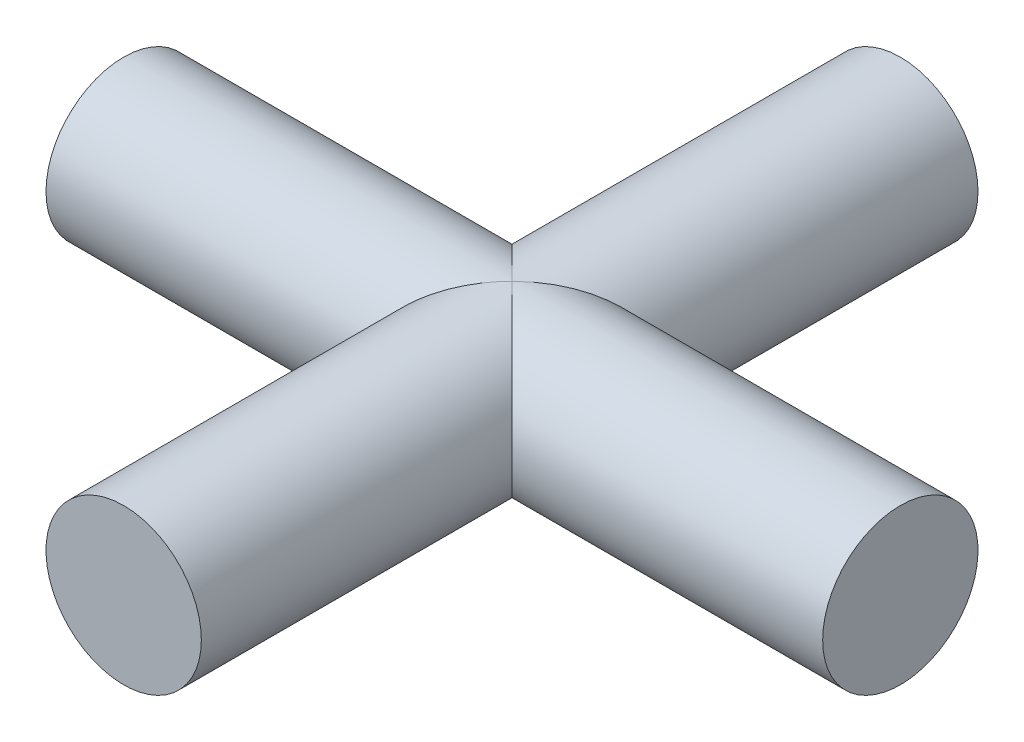
ISO-10303-21;
HEADER;
FILE_DESCRIPTION(('STEP AP214'),'2;1');
FILE_NAME('part.step','',(''),(''),'','','');
FILE_SCHEMA(('AUTOMOTIVE_DESIGN { 1 0 10303 214 1 1 1 1 }'));
ENDSEC;
DATA;
#1=APPLICATION_CONTEXT('core data for automotive mechanical design processes');
#2=APPLICATION_PROTOCOL_DEFINITION('international standard','automotive_design',2000,#1);
#3=PRODUCT_CONTEXT('',#1,'mechanical');
#4=PRODUCT('Part','Part','',(#3));
#5=PRODUCT_RELATED_PRODUCT_CATEGORY('part','',(#4));
#6=PRODUCT_DEFINITION_FORMATION('','',#4);
#7=PRODUCT_DEFINITION_CONTEXT('part definition',#1,'design');
#8=PRODUCT_DEFINITION('design','',#6,#7);
#9=PRODUCT_DEFINITION_SHAPE('','',#8);
#10=(LENGTH_UNIT() NAMED_UNIT(*) SI_UNIT(.MILLI.,.METRE.));
#11=(NAMED_UNIT(*) PLANE_ANGLE_UNIT() SI_UNIT($,.RADIAN.));
#12=(NAMED_UNIT(*) SI_UNIT($,.STERADIAN.) SOLID_ANGLE_UNIT());
#13=UNCERTAINTY_MEASURE_WITH_UNIT(LENGTH_MEASURE(1.E-05),#10,'distance_accuracy_value','');
#14=(GEOMETRIC_REPRESENTATION_CONTEXT(3) GLOBAL_UNCERTAINTY_ASSIGNED_CONTEXT((#13)) GLOBAL_UNIT_ASSIGNED_CONTEXT((#10,
#11,#12)) REPRESENTATION_CONTEXT('',''));
#15=CARTESIAN_POINT('',(0.,0.,0.));
#16=DIRECTION('',(0.,0.,1.));
#17=DIRECTION('',(1.,0.,0.));
#18=AXIS2_PLACEMENT_3D('',#15,#16,#17);
#19=CARTESIAN_POINT('',(0.,0.,63.5));
#20=DIRECTION('',(0.,0.,-1.));
#21=DIRECTION('',(-1.,0.,0.));
#22=AXIS2_PLACEMENT_3D('',#19,#20,#21);
#23=CYLINDRICAL_SURFACE('',#22,6.35);
#24=CARTESIAN_POINT('',(0.,0.,63.5));
#25=DIRECTION('',(0.,0.,1.));
#26=DIRECTION('',(1.,0.,0.));
#27=AXIS2_PLACEMENT_3D('',#24,#25,#26);
#28=CIRCLE('',#27,6.35);
#29=CARTESIAN_POINT('',(6.35,0.,63.5));
#30=VERTEX_POINT('',#29);
#31=EDGE_CURVE('E66',#30,#30,#28,.T.);
#32=ORIENTED_EDGE('',*,*,#31,.F.);
#33=EDGE_LOOP('',(#32));
#34=FACE_BOUND('',#33,.T.);
#35=CARTESIAN_POINT('',(0.,0.,31.75));
#36=DIRECTION('',(0.707106781186549,0.,-0.707106781186546));
#37=DIRECTION('',(-0.707106781186546,0.,-0.707106781186549));
#38=AXIS2_PLACEMENT_3D('',#35,#36,#37);
#39=ELLIPSE('',#38,8.98025612106917,6.35);
#40=CARTESIAN_POINT('',(0.,6.35,31.75));
#41=VERTEX_POINT('',#40);
#42=CARTESIAN_POINT('',(0.,-6.35,31.75));
#43=VERTEX_POINT('',#42);
#44=EDGE_CURVE('E48',#41,#43,#39,.T.);
#45=ORIENTED_EDGE('',*,*,#44,.F.);
#46=CARTESIAN_POINT('',(0.,0.,31.75));
#47=DIRECTION('',(-0.707106781186546,0.,-0.707106781186549));
#48=DIRECTION('',(0.707106781186549,0.,-0.707106781186546));
#49=AXIS2_PLACEMENT_3D('',#46,#47,#48);
#50=ELLIPSE('',#49,8.98025612106913,6.35);
#51=EDGE_CURVE('E60',#43,#41,#50,.T.);
#52=ORIENTED_EDGE('',*,*,#51,.F.);
#53=EDGE_LOOP('',(#45,#52));
#54=FACE_BOUND('',#53,.T.);
#55=ADVANCED_FACE('F39',(#34,#54),#23,.T.);
#56=CARTESIAN_POINT('',(0.,0.,63.5));
#57=DIRECTION('',(0.,0.,1.));
#58=DIRECTION('',(1.,0.,0.));
#59=AXIS2_PLACEMENT_3D('',#56,#57,#58);
#60=PLANE('',#59);
#61=ORIENTED_EDGE('',*,*,#31,.T.);
#62=EDGE_LOOP('',(#61));
#63=FACE_BOUND('',#62,.T.);
#64=ADVANCED_FACE('F90',(#63),#60,.T.);
#65=CARTESIAN_POINT('',(31.75,0.,31.7500000000001));
#66=DIRECTION('',(-1.,0.,0.));
#67=DIRECTION('',(0.,0.,1.));
#68=AXIS2_PLACEMENT_3D('',#65,#66,#67);
#69=PLANE('',#68);
#70=CARTESIAN_POINT('',(31.75,0.,31.7500000000001));
#71=DIRECTION('',(-1.,0.,0.));
#72=DIRECTION('',(0.,0.,1.));
#73=AXIS2_PLACEMENT_3D('',#70,#71,#72);
#74=CIRCLE('',#73,6.35);
#75=CARTESIAN_POINT('',(31.75,0.,38.1000000000001));
#76=VERTEX_POINT('',#75);
#77=EDGE_CURVE('E106',#76,#76,#74,.T.);
#78=ORIENTED_EDGE('',*,*,#77,.F.);
#79=EDGE_LOOP('',(#78));
#80=FACE_BOUND('',#79,.T.);
#81=ADVANCED_FACE('F87',(#80),#69,.F.);
#82=CARTESIAN_POINT('',(-31.75,0.,31.7499999999999));
#83=DIRECTION('',(1.,0.,0.));
#84=DIRECTION('',(0.,0.,-1.));
#85=AXIS2_PLACEMENT_3D('',#82,#83,#84);
#86=CYLINDRICAL_SURFACE('',#85,6.35);
#87=ORIENTED_EDGE('',*,*,#77,.T.);
#88=EDGE_LOOP('',(#87));
#89=FACE_BOUND('',#88,.T.);
#90=CARTESIAN_POINT('',(0.,0.,31.75));
#91=DIRECTION('',(-0.707106781186546,0.,-0.707106781186549));
#92=DIRECTION('',(0.707106781186549,0.,-0.707106781186546));
#93=AXIS2_PLACEMENT_3D('',#90,#91,#92);
#94=ELLIPSE('',#93,8.98025612106913,6.35);
#95=EDGE_CURVE('E54',#43,#41,#94,.F.);
#96=ORIENTED_EDGE('',*,*,#95,.T.);
#97=ORIENTED_EDGE('',*,*,#44,.T.);
#98=EDGE_LOOP('',(#96,#97));
#99=FACE_BOUND('',#98,.T.);
#100=ADVANCED_FACE('F68',(#89,#99),#86,.T.);
#101=CARTESIAN_POINT('',(0.,0.,0.));
#102=DIRECTION('',(0.,0.,1.));
#103=DIRECTION('',(1.,0.,0.));
#104=AXIS2_PLACEMENT_3D('',#101,#102,#103);
#105=PLANE('',#104);
#106=CARTESIAN_POINT('',(0.,0.,0.));
#107=DIRECTION('',(0.,0.,1.));
#108=DIRECTION('',(1.,0.,0.));
#109=AXIS2_PLACEMENT_3D('',#106,#107,#108);
#110=CIRCLE('',#109,6.35);
#111=CARTESIAN_POINT('',(6.35,0.,0.));
#112=VERTEX_POINT('',#111);
#113=EDGE_CURVE('E99',#112,#112,#110,.T.);
#114=ORIENTED_EDGE('',*,*,#113,.F.);
#115=EDGE_LOOP('',(#114));
#116=FACE_BOUND('',#115,.T.);
#117=ADVANCED_FACE('F81',(#116),#105,.F.);
#118=ORIENTED_EDGE('',*,*,#113,.T.);
#119=EDGE_LOOP('',(#118));
#120=FACE_BOUND('',#119,.T.);
#121=CARTESIAN_POINT('',(0.,0.,31.75));
#122=DIRECTION('',(0.707106781186549,0.,-0.707106781186546));
#123=DIRECTION('',(-0.707106781186546,0.,-0.707106781186549));
#124=AXIS2_PLACEMENT_3D('',#121,#122,#123);
#125=ELLIPSE('',#124,8.98025612106917,6.35);
#126=EDGE_CURVE('E11',#41,#43,#125,.F.);
#127=ORIENTED_EDGE('',*,*,#126,.F.);
#128=ORIENTED_EDGE('',*,*,#95,.F.);
#129=EDGE_LOOP('',(#127,#128));
#130=FACE_BOUND('',#129,.T.);
#131=ADVANCED_FACE('F41',(#120,#130),#23,.T.);
#132=CARTESIAN_POINT('',(-31.75,0.,31.7499999999999));
#133=DIRECTION('',(-1.,0.,0.));
#134=DIRECTION('',(0.,0.,1.));
#135=AXIS2_PLACEMENT_3D('',#132,#133,#134);
#136=CIRCLE('',#135,6.35);
#137=CARTESIAN_POINT('',(-31.75,0.,38.0999999999999));
#138=VERTEX_POINT('',#137);
#139=EDGE_CURVE('E103',#138,#138,#136,.T.);
#140=ORIENTED_EDGE('',*,*,#139,.F.);
#141=EDGE_LOOP('',(#140));
#142=FACE_BOUND('',#141,.T.);
#143=ORIENTED_EDGE('',*,*,#51,.T.);
#144=ORIENTED_EDGE('',*,*,#126,.T.);
#145=EDGE_LOOP('',(#143,#144));
#146=FACE_BOUND('',#145,.T.);
#147=ADVANCED_FACE('F70',(#142,#146),#86,.T.);
#148=CARTESIAN_POINT('',(-31.75,0.,31.7499999999999));
#149=DIRECTION('',(-1.,0.,0.));
#150=DIRECTION('',(0.,0.,1.));
#151=AXIS2_PLACEMENT_3D('',#148,#149,#150);
#152=PLANE('',#151);
#153=ORIENTED_EDGE('',*,*,#139,.T.);
#154=EDGE_LOOP('',(#153));
#155=FACE_BOUND('',#154,.T.);
#156=ADVANCED_FACE('F72',(#155),#152,.T.);
#157=CLOSED_SHELL('',(#55,#64,#81,#100,#117,#131,#147,#156));
#158=MANIFOLD_SOLID_BREP('B2',#157);
#159=ADVANCED_BREP_SHAPE_REPRESENTATION('',(#18,#158),#14);
#160=SHAPE_DEFINITION_REPRESENTATION(#9,#159);
ENDSEC;
END-ISO-10303-21;
